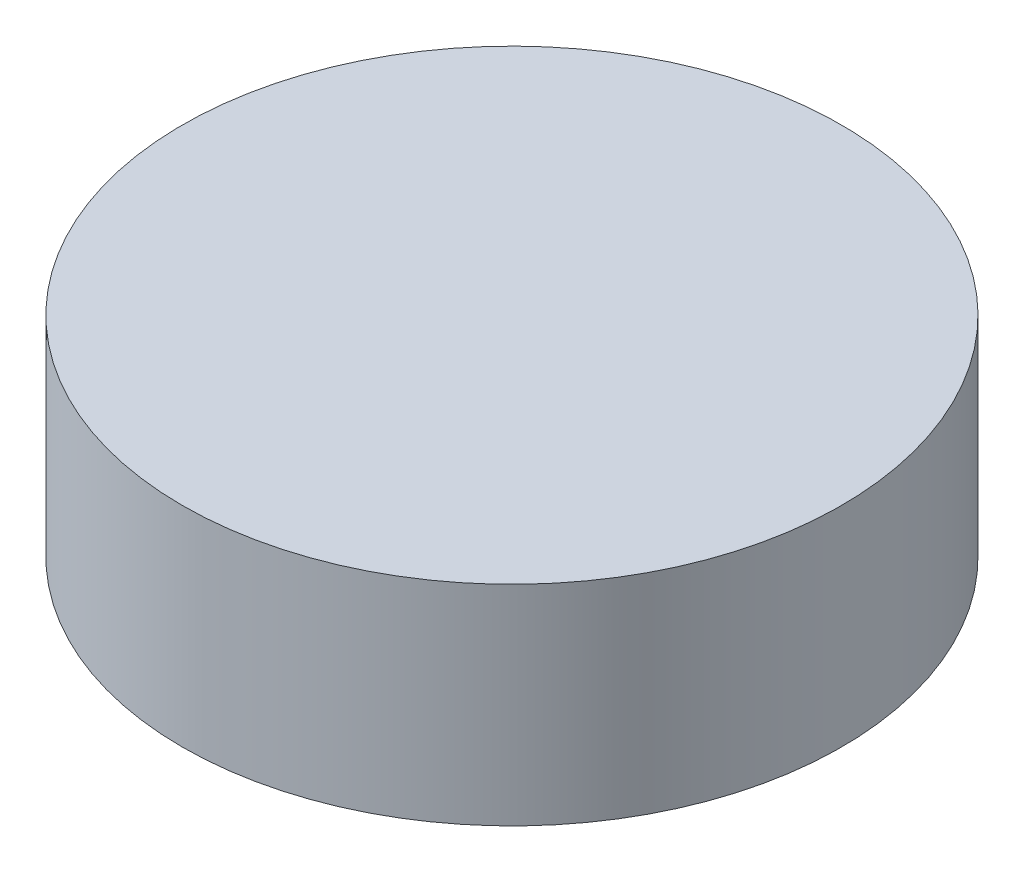
ISO-10303-21;
HEADER;
FILE_DESCRIPTION(('STEP AP214'),'2;1');
FILE_NAME('part.step','',(''),(''),'','','');
FILE_SCHEMA(('AUTOMOTIVE_DESIGN { 1 0 10303 214 1 1 1 1 }'));
ENDSEC;
DATA;
#1=APPLICATION_CONTEXT('core data for automotive mechanical design processes');
#2=APPLICATION_PROTOCOL_DEFINITION('international standard','automotive_design',2000,#1);
#3=PRODUCT_CONTEXT('',#1,'mechanical');
#4=PRODUCT('Part','Part','',(#3));
#5=PRODUCT_RELATED_PRODUCT_CATEGORY('part','',(#4));
#6=PRODUCT_DEFINITION_FORMATION('','',#4);
#7=PRODUCT_DEFINITION_CONTEXT('part definition',#1,'design');
#8=PRODUCT_DEFINITION('design','',#6,#7);
#9=PRODUCT_DEFINITION_SHAPE('','',#8);
#10=(LENGTH_UNIT() NAMED_UNIT(*) SI_UNIT(.MILLI.,.METRE.));
#11=(NAMED_UNIT(*) PLANE_ANGLE_UNIT() SI_UNIT($,.RADIAN.));
#12=(NAMED_UNIT(*) SI_UNIT($,.STERADIAN.) SOLID_ANGLE_UNIT());
#13=UNCERTAINTY_MEASURE_WITH_UNIT(LENGTH_MEASURE(1.E-05),#10,'distance_accuracy_value','');
#14=(GEOMETRIC_REPRESENTATION_CONTEXT(3) GLOBAL_UNCERTAINTY_ASSIGNED_CONTEXT((#13)) GLOBAL_UNIT_ASSIGNED_CONTEXT((#10,
#11,#12)) REPRESENTATION_CONTEXT('',''));
#15=CARTESIAN_POINT('',(0.,0.,0.));
#16=DIRECTION('',(0.,0.,1.));
#17=DIRECTION('',(1.,0.,0.));
#18=AXIS2_PLACEMENT_3D('',#15,#16,#17);
#19=CARTESIAN_POINT('',(0.,3.175,0.));
#20=DIRECTION('',(0.,-1.,0.));
#21=DIRECTION('',(0.,0.,-1.));
#22=AXIS2_PLACEMENT_3D('',#19,#20,#21);
#23=CYLINDRICAL_SURFACE('',#22,5.);
#24=CARTESIAN_POINT('',(0.,3.175,0.));
#25=DIRECTION('',(0.,1.,0.));
#26=DIRECTION('',(0.,0.,1.));
#27=AXIS2_PLACEMENT_3D('',#24,#25,#26);
#28=CIRCLE('',#27,5.);
#29=CARTESIAN_POINT('',(0.,3.175,5.));
#30=VERTEX_POINT('',#29);
#31=EDGE_CURVE('E10',#30,#30,#28,.T.);
#32=ORIENTED_EDGE('',*,*,#31,.F.);
#33=EDGE_LOOP('',(#32));
#34=FACE_BOUND('',#33,.T.);
#35=CARTESIAN_POINT('',(0.,0.,0.));
#36=DIRECTION('',(0.,1.,0.));
#37=DIRECTION('',(0.,0.,1.));
#38=AXIS2_PLACEMENT_3D('',#35,#36,#37);
#39=CIRCLE('',#38,5.);
#40=CARTESIAN_POINT('',(0.,0.,5.));
#41=VERTEX_POINT('',#40);
#42=EDGE_CURVE('E34',#41,#41,#39,.T.);
#43=ORIENTED_EDGE('',*,*,#42,.T.);
#44=EDGE_LOOP('',(#43));
#45=FACE_BOUND('',#44,.T.);
#46=ADVANCED_FACE('F31',(#34,#45),#23,.T.);
#47=CARTESIAN_POINT('',(0.,3.175,0.));
#48=DIRECTION('',(0.,1.,0.));
#49=DIRECTION('',(0.,0.,1.));
#50=AXIS2_PLACEMENT_3D('',#47,#48,#49);
#51=PLANE('',#50);
#52=ORIENTED_EDGE('',*,*,#31,.T.);
#53=EDGE_LOOP('',(#52));
#54=FACE_BOUND('',#53,.T.);
#55=ADVANCED_FACE('F46',(#54),#51,.T.);
#56=CARTESIAN_POINT('',(0.,0.,0.));
#57=DIRECTION('',(0.,1.,0.));
#58=DIRECTION('',(0.,0.,1.));
#59=AXIS2_PLACEMENT_3D('',#56,#57,#58);
#60=PLANE('',#59);
#61=ORIENTED_EDGE('',*,*,#42,.F.);
#62=EDGE_LOOP('',(#61));
#63=FACE_BOUND('',#62,.T.);
#64=ADVANCED_FACE('F44',(#63),#60,.F.);
#65=CLOSED_SHELL('',(#46,#55,#64));
#66=MANIFOLD_SOLID_BREP('B2',#65);
#67=ADVANCED_BREP_SHAPE_REPRESENTATION('',(#18,#66),#14);
#68=SHAPE_DEFINITION_REPRESENTATION(#9,#67);
ENDSEC;
END-ISO-10303-21;
